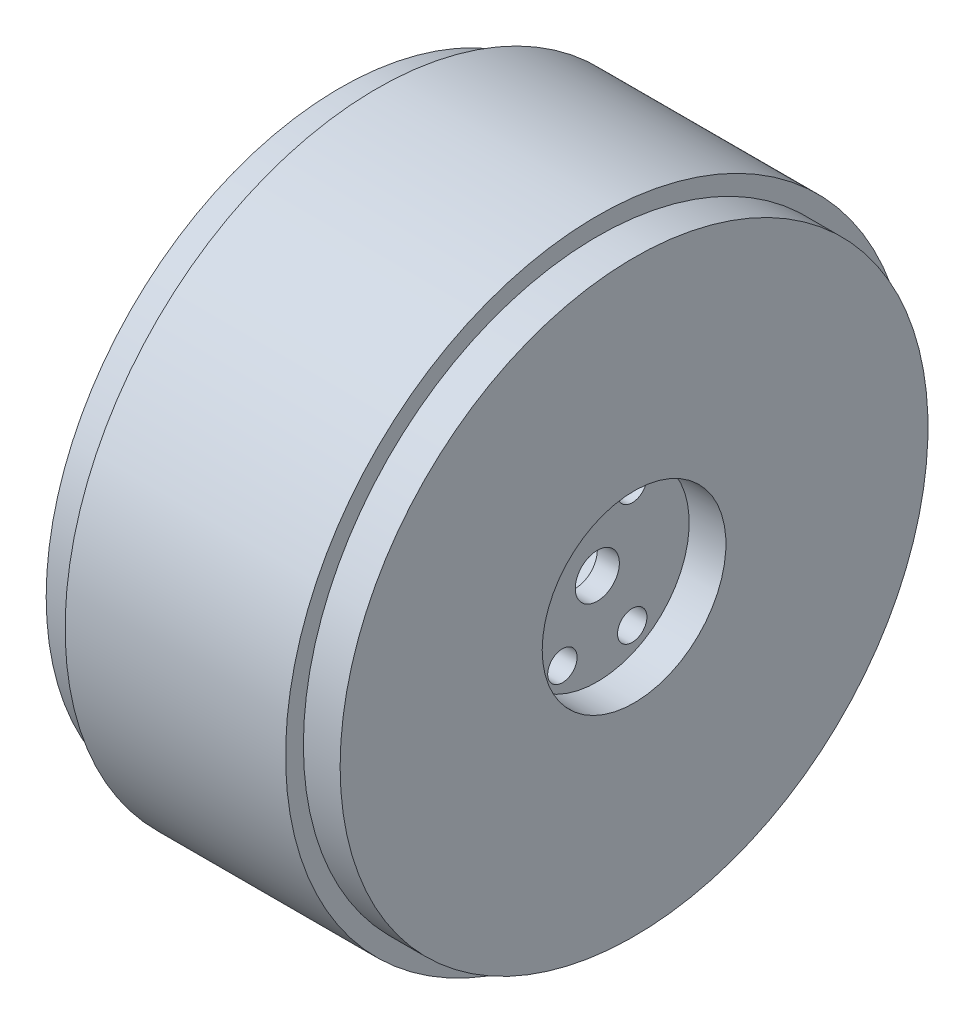
ISO-10303-21;
HEADER;
FILE_DESCRIPTION(('STEP AP214'),'2;1');
FILE_NAME('part.step','',(''),(''),'','','');
FILE_SCHEMA(('AUTOMOTIVE_DESIGN { 1 0 10303 214 1 1 1 1 }'));
ENDSEC;
DATA;
#1=APPLICATION_CONTEXT('core data for automotive mechanical design processes');
#2=APPLICATION_PROTOCOL_DEFINITION('international standard','automotive_design',2000,#1);
#3=PRODUCT_CONTEXT('',#1,'mechanical');
#4=PRODUCT('Part','Part','',(#3));
#5=PRODUCT_RELATED_PRODUCT_CATEGORY('part','',(#4));
#6=PRODUCT_DEFINITION_FORMATION('','',#4);
#7=PRODUCT_DEFINITION_CONTEXT('part definition',#1,'design');
#8=PRODUCT_DEFINITION('design','',#6,#7);
#9=PRODUCT_DEFINITION_SHAPE('','',#8);
#10=(LENGTH_UNIT() NAMED_UNIT(*) SI_UNIT(.MILLI.,.METRE.));
#11=(NAMED_UNIT(*) PLANE_ANGLE_UNIT() SI_UNIT($,.RADIAN.));
#12=(NAMED_UNIT(*) SI_UNIT($,.STERADIAN.) SOLID_ANGLE_UNIT());
#13=UNCERTAINTY_MEASURE_WITH_UNIT(LENGTH_MEASURE(1.E-05),#10,'distance_accuracy_value','');
#14=(GEOMETRIC_REPRESENTATION_CONTEXT(3) GLOBAL_UNCERTAINTY_ASSIGNED_CONTEXT((#13)) GLOBAL_UNIT_ASSIGNED_CONTEXT((#10,
#11,#12)) REPRESENTATION_CONTEXT('',''));
#15=CARTESIAN_POINT('',(0.,0.,0.));
#16=DIRECTION('',(0.,0.,1.));
#17=DIRECTION('',(1.,0.,0.));
#18=AXIS2_PLACEMENT_3D('',#15,#16,#17);
#19=CARTESIAN_POINT('',(-49.6444990272902,0.,0.));
#20=DIRECTION('',(-1.,0.,0.));
#21=DIRECTION('',(0.,0.,1.));
#22=AXIS2_PLACEMENT_3D('',#19,#20,#21);
#23=CYLINDRICAL_SURFACE('',#22,34.);
#24=CARTESIAN_POINT('',(0.,0.,0.));
#25=DIRECTION('',(-1.,0.,0.));
#26=DIRECTION('',(0.,0.,1.));
#27=AXIS2_PLACEMENT_3D('',#24,#25,#26);
#28=CIRCLE('',#27,34.);
#29=CARTESIAN_POINT('',(0.,0.,34.));
#30=VERTEX_POINT('',#29);
#31=EDGE_CURVE('E51',#30,#30,#28,.T.);
#32=ORIENTED_EDGE('',*,*,#31,.F.);
#33=EDGE_LOOP('',(#32));
#34=FACE_BOUND('',#33,.T.);
#35=CARTESIAN_POINT('',(-32.,0.,0.));
#36=DIRECTION('',(-1.,0.,0.));
#37=DIRECTION('',(0.,0.,1.));
#38=AXIS2_PLACEMENT_3D('',#35,#36,#37);
#39=CIRCLE('',#38,34.);
#40=CARTESIAN_POINT('',(-32.,0.,34.));
#41=VERTEX_POINT('',#40);
#42=EDGE_CURVE('E10',#41,#41,#39,.T.);
#43=ORIENTED_EDGE('',*,*,#42,.T.);
#44=EDGE_LOOP('',(#43));
#45=FACE_BOUND('',#44,.T.);
#46=ADVANCED_FACE('F32',(#34,#45),#23,.F.);
#47=CARTESIAN_POINT('',(-32.,34.,0.));
#48=DIRECTION('',(1.,0.,0.));
#49=DIRECTION('',(0.,0.,-1.));
#50=AXIS2_PLACEMENT_3D('',#47,#48,#49);
#51=PLANE('',#50);
#52=ORIENTED_EDGE('',*,*,#42,.F.);
#53=EDGE_LOOP('',(#52));
#54=FACE_BOUND('',#53,.T.);
#55=CARTESIAN_POINT('',(-32.,0.,0.));
#56=DIRECTION('',(-1.,0.,0.));
#57=DIRECTION('',(0.,0.,1.));
#58=AXIS2_PLACEMENT_3D('',#55,#56,#57);
#59=CIRCLE('',#58,40.);
#60=CARTESIAN_POINT('',(-32.,0.,40.));
#61=VERTEX_POINT('',#60);
#62=EDGE_CURVE('E38',#61,#61,#59,.T.);
#63=ORIENTED_EDGE('',*,*,#62,.T.);
#64=EDGE_LOOP('',(#63));
#65=FACE_BOUND('',#64,.T.);
#66=ADVANCED_FACE('F114',(#54,#65),#51,.F.);
#67=CARTESIAN_POINT('',(-49.6444990272902,0.,0.));
#68=DIRECTION('',(-1.,0.,0.));
#69=DIRECTION('',(0.,0.,1.));
#70=AXIS2_PLACEMENT_3D('',#67,#68,#69);
#71=CYLINDRICAL_SURFACE('',#70,40.);
#72=ORIENTED_EDGE('',*,*,#62,.F.);
#73=EDGE_LOOP('',(#72));
#74=FACE_BOUND('',#73,.T.);
#75=CARTESIAN_POINT('',(-27.,0.,0.));
#76=DIRECTION('',(-1.,0.,0.));
#77=DIRECTION('',(0.,0.,1.));
#78=AXIS2_PLACEMENT_3D('',#75,#76,#77);
#79=CIRCLE('',#78,40.);
#80=CARTESIAN_POINT('',(-27.,0.,40.));
#81=VERTEX_POINT('',#80);
#82=EDGE_CURVE('E90',#81,#81,#79,.T.);
#83=ORIENTED_EDGE('',*,*,#82,.T.);
#84=EDGE_LOOP('',(#83));
#85=FACE_BOUND('',#84,.T.);
#86=ADVANCED_FACE('F119',(#74,#85),#71,.T.);
#87=CARTESIAN_POINT('',(-49.6444990272902,0.,0.));
#88=DIRECTION('',(-1.,0.,0.));
#89=DIRECTION('',(0.,0.,1.));
#90=AXIS2_PLACEMENT_3D('',#87,#88,#89);
#91=CYLINDRICAL_SURFACE('',#90,40.);
#92=CARTESIAN_POINT('',(3.,0.,0.));
#93=DIRECTION('',(-1.,0.,0.));
#94=DIRECTION('',(0.,0.,1.));
#95=AXIS2_PLACEMENT_3D('',#92,#93,#94);
#96=CIRCLE('',#95,40.);
#97=CARTESIAN_POINT('',(3.,0.,40.));
#98=VERTEX_POINT('',#97);
#99=EDGE_CURVE('E42',#98,#98,#96,.T.);
#100=ORIENTED_EDGE('',*,*,#99,.F.);
#101=EDGE_LOOP('',(#100));
#102=FACE_BOUND('',#101,.T.);
#103=CARTESIAN_POINT('',(8.,0.,0.));
#104=DIRECTION('',(-1.,0.,0.));
#105=DIRECTION('',(0.,0.,1.));
#106=AXIS2_PLACEMENT_3D('',#103,#104,#105);
#107=CIRCLE('',#106,40.);
#108=CARTESIAN_POINT('',(8.,0.,40.));
#109=VERTEX_POINT('',#108);
#110=EDGE_CURVE('E46',#109,#109,#107,.T.);
#111=ORIENTED_EDGE('',*,*,#110,.T.);
#112=EDGE_LOOP('',(#111));
#113=FACE_BOUND('',#112,.T.);
#114=ADVANCED_FACE('F136',(#102,#113),#91,.T.);
#115=CARTESIAN_POINT('',(8.,40.,0.));
#116=DIRECTION('',(-1.,0.,0.));
#117=DIRECTION('',(0.,0.,1.));
#118=AXIS2_PLACEMENT_3D('',#115,#116,#117);
#119=PLANE('',#118);
#120=CARTESIAN_POINT('',(8.,0.,0.));
#121=DIRECTION('',(-1.,0.,0.));
#122=DIRECTION('',(0.,0.,1.));
#123=AXIS2_PLACEMENT_3D('',#120,#121,#122);
#124=CIRCLE('',#123,12.5);
#125=CARTESIAN_POINT('',(8.,0.,12.5));
#126=VERTEX_POINT('',#125);
#127=EDGE_CURVE('E54',#126,#126,#124,.T.);
#128=ORIENTED_EDGE('',*,*,#127,.T.);
#129=EDGE_LOOP('',(#128));
#130=FACE_BOUND('',#129,.T.);
#131=ORIENTED_EDGE('',*,*,#110,.F.);
#132=EDGE_LOOP('',(#131));
#133=FACE_BOUND('',#132,.T.);
#134=ADVANCED_FACE('F126',(#130,#133),#119,.F.);
#135=CARTESIAN_POINT('',(0.,34.,0.));
#136=DIRECTION('',(1.,0.,0.));
#137=DIRECTION('',(0.,0.,-1.));
#138=AXIS2_PLACEMENT_3D('',#135,#136,#137);
#139=PLANE('',#138);
#140=CARTESIAN_POINT('',(0.,0.,0.));
#141=DIRECTION('',(1.,0.,0.));
#142=DIRECTION('',(0.,0.,-1.));
#143=AXIS2_PLACEMENT_3D('',#140,#141,#142);
#144=CIRCLE('',#143,3.);
#145=CARTESIAN_POINT('',(0.,0.,-3.));
#146=VERTEX_POINT('',#145);
#147=EDGE_CURVE('E84',#146,#146,#144,.T.);
#148=ORIENTED_EDGE('',*,*,#147,.T.);
#149=EDGE_LOOP('',(#148));
#150=FACE_BOUND('',#149,.T.);
#151=CARTESIAN_POINT('',(0.,8.22724133595216,4.75000000000001));
#152=DIRECTION('',(1.,0.,0.));
#153=DIRECTION('',(0.,0.,-1.));
#154=AXIS2_PLACEMENT_3D('',#151,#152,#153);
#155=CIRCLE('',#154,2.);
#156=CARTESIAN_POINT('',(0.,8.22724133595216,2.75000000000001));
#157=VERTEX_POINT('',#156);
#158=EDGE_CURVE('E60',#157,#157,#155,.T.);
#159=ORIENTED_EDGE('',*,*,#158,.T.);
#160=EDGE_LOOP('',(#159));
#161=FACE_BOUND('',#160,.T.);
#162=CARTESIAN_POINT('',(0.,-8.22724133595216,-4.75000000000001));
#163=DIRECTION('',(1.,0.,0.));
#164=DIRECTION('',(0.,0.,-1.));
#165=AXIS2_PLACEMENT_3D('',#162,#163,#164);
#166=CIRCLE('',#165,2.);
#167=CARTESIAN_POINT('',(0.,-8.22724133595216,-6.75000000000001));
#168=VERTEX_POINT('',#167);
#169=EDGE_CURVE('E63',#168,#168,#166,.T.);
#170=ORIENTED_EDGE('',*,*,#169,.T.);
#171=EDGE_LOOP('',(#170));
#172=FACE_BOUND('',#171,.T.);
#173=CARTESIAN_POINT('',(0.,-8.22724133595216,4.75000000000001));
#174=DIRECTION('',(1.,0.,0.));
#175=DIRECTION('',(0.,0.,-1.));
#176=AXIS2_PLACEMENT_3D('',#173,#174,#175);
#177=CIRCLE('',#176,2.);
#178=CARTESIAN_POINT('',(0.,-8.22724133595216,2.75000000000001));
#179=VERTEX_POINT('',#178);
#180=EDGE_CURVE('E66',#179,#179,#177,.T.);
#181=ORIENTED_EDGE('',*,*,#180,.T.);
#182=EDGE_LOOP('',(#181));
#183=FACE_BOUND('',#182,.T.);
#184=CARTESIAN_POINT('',(0.,8.22724133595216,-4.75000000000001));
#185=DIRECTION('',(1.,0.,0.));
#186=DIRECTION('',(0.,0.,-1.));
#187=AXIS2_PLACEMENT_3D('',#184,#185,#186);
#188=CIRCLE('',#187,2.);
#189=CARTESIAN_POINT('',(0.,8.22724133595216,-6.75000000000001));
#190=VERTEX_POINT('',#189);
#191=EDGE_CURVE('E69',#190,#190,#188,.T.);
#192=ORIENTED_EDGE('',*,*,#191,.T.);
#193=EDGE_LOOP('',(#192));
#194=FACE_BOUND('',#193,.T.);
#195=ORIENTED_EDGE('',*,*,#31,.T.);
#196=EDGE_LOOP('',(#195));
#197=FACE_BOUND('',#196,.T.);
#198=ADVANCED_FACE('F123',(#150,#161,#172,#183,#194,#197),#139,.F.);
#199=CARTESIAN_POINT('',(0.,0.,0.));
#200=DIRECTION('',(-1.,0.,0.));
#201=DIRECTION('',(0.,0.,1.));
#202=AXIS2_PLACEMENT_3D('',#199,#200,#201);
#203=CYLINDRICAL_SURFACE('',#202,12.5);
#204=CARTESIAN_POINT('',(3.,0.,0.));
#205=DIRECTION('',(-1.,0.,0.));
#206=DIRECTION('',(0.,0.,1.));
#207=AXIS2_PLACEMENT_3D('',#204,#205,#206);
#208=CIRCLE('',#207,12.5);
#209=CARTESIAN_POINT('',(3.,0.,12.5));
#210=VERTEX_POINT('',#209);
#211=EDGE_CURVE('E57',#210,#210,#208,.T.);
#212=ORIENTED_EDGE('',*,*,#211,.T.);
#213=EDGE_LOOP('',(#212));
#214=FACE_BOUND('',#213,.T.);
#215=ORIENTED_EDGE('',*,*,#127,.F.);
#216=EDGE_LOOP('',(#215));
#217=FACE_BOUND('',#216,.T.);
#218=ADVANCED_FACE('F125',(#214,#217),#203,.F.);
#219=CARTESIAN_POINT('',(3.,12.5,0.));
#220=DIRECTION('',(1.,0.,0.));
#221=DIRECTION('',(0.,0.,-1.));
#222=AXIS2_PLACEMENT_3D('',#219,#220,#221);
#223=PLANE('',#222);
#224=CARTESIAN_POINT('',(3.,0.,0.));
#225=DIRECTION('',(1.,0.,0.));
#226=DIRECTION('',(0.,0.,-1.));
#227=AXIS2_PLACEMENT_3D('',#224,#225,#226);
#228=CIRCLE('',#227,3.);
#229=CARTESIAN_POINT('',(3.,0.,-3.));
#230=VERTEX_POINT('',#229);
#231=EDGE_CURVE('E87',#230,#230,#228,.T.);
#232=ORIENTED_EDGE('',*,*,#231,.F.);
#233=EDGE_LOOP('',(#232));
#234=FACE_BOUND('',#233,.T.);
#235=CARTESIAN_POINT('',(3.,8.22724133595216,4.75000000000001));
#236=DIRECTION('',(1.,0.,0.));
#237=DIRECTION('',(0.,0.,1.));
#238=AXIS2_PLACEMENT_3D('',#235,#236,#237);
#239=CIRCLE('',#238,2.);
#240=CARTESIAN_POINT('',(3.,8.22724133595216,6.75000000000001));
#241=VERTEX_POINT('',#240);
#242=EDGE_CURVE('E75',#241,#241,#239,.T.);
#243=ORIENTED_EDGE('',*,*,#242,.F.);
#244=EDGE_LOOP('',(#243));
#245=FACE_BOUND('',#244,.T.);
#246=CARTESIAN_POINT('',(3.,-8.22724133595216,-4.75000000000001));
#247=DIRECTION('',(1.,0.,0.));
#248=DIRECTION('',(0.,0.,1.));
#249=AXIS2_PLACEMENT_3D('',#246,#247,#248);
#250=CIRCLE('',#249,2.);
#251=CARTESIAN_POINT('',(3.,-8.22724133595216,-2.75000000000001));
#252=VERTEX_POINT('',#251);
#253=EDGE_CURVE('E76',#252,#252,#250,.T.);
#254=ORIENTED_EDGE('',*,*,#253,.F.);
#255=EDGE_LOOP('',(#254));
#256=FACE_BOUND('',#255,.T.);
#257=CARTESIAN_POINT('',(3.,-8.22724133595216,4.75000000000001));
#258=DIRECTION('',(1.,0.,0.));
#259=DIRECTION('',(0.,0.,-1.));
#260=AXIS2_PLACEMENT_3D('',#257,#258,#259);
#261=CIRCLE('',#260,2.);
#262=CARTESIAN_POINT('',(3.,-8.22724133595216,2.75000000000001));
#263=VERTEX_POINT('',#262);
#264=EDGE_CURVE('E79',#263,#263,#261,.T.);
#265=ORIENTED_EDGE('',*,*,#264,.F.);
#266=EDGE_LOOP('',(#265));
#267=FACE_BOUND('',#266,.T.);
#268=CARTESIAN_POINT('',(3.,8.22724133595216,-4.75000000000001));
#269=DIRECTION('',(1.,0.,0.));
#270=DIRECTION('',(0.,0.,-1.));
#271=AXIS2_PLACEMENT_3D('',#268,#269,#270);
#272=CIRCLE('',#271,2.);
#273=CARTESIAN_POINT('',(3.,8.22724133595216,-6.75000000000001));
#274=VERTEX_POINT('',#273);
#275=EDGE_CURVE('E72',#274,#274,#272,.T.);
#276=ORIENTED_EDGE('',*,*,#275,.F.);
#277=EDGE_LOOP('',(#276));
#278=FACE_BOUND('',#277,.T.);
#279=ORIENTED_EDGE('',*,*,#211,.F.);
#280=EDGE_LOOP('',(#279));
#281=FACE_BOUND('',#280,.T.);
#282=ADVANCED_FACE('F133',(#234,#245,#256,#267,#278,#281),#223,.T.);
#283=CARTESIAN_POINT('',(-32.,8.22724133595216,-4.75000000000001));
#284=DIRECTION('',(1.,0.,0.));
#285=DIRECTION('',(0.,0.,-1.));
#286=AXIS2_PLACEMENT_3D('',#283,#284,#285);
#287=CYLINDRICAL_SURFACE('',#286,2.);
#288=ORIENTED_EDGE('',*,*,#275,.T.);
#289=EDGE_LOOP('',(#288));
#290=FACE_BOUND('',#289,.T.);
#291=ORIENTED_EDGE('',*,*,#191,.F.);
#292=EDGE_LOOP('',(#291));
#293=FACE_BOUND('',#292,.T.);
#294=ADVANCED_FACE('F167',(#290,#293),#287,.F.);
#295=CARTESIAN_POINT('',(-32.,-8.22724133595216,4.75000000000001));
#296=DIRECTION('',(1.,0.,0.));
#297=DIRECTION('',(0.,0.,-1.));
#298=AXIS2_PLACEMENT_3D('',#295,#296,#297);
#299=CYLINDRICAL_SURFACE('',#298,2.);
#300=ORIENTED_EDGE('',*,*,#264,.T.);
#301=EDGE_LOOP('',(#300));
#302=FACE_BOUND('',#301,.T.);
#303=ORIENTED_EDGE('',*,*,#180,.F.);
#304=EDGE_LOOP('',(#303));
#305=FACE_BOUND('',#304,.T.);
#306=ADVANCED_FACE('F163',(#302,#305),#299,.F.);
#307=CARTESIAN_POINT('',(-32.,-8.22724133595216,-4.75000000000001));
#308=DIRECTION('',(1.,0.,0.));
#309=DIRECTION('',(0.,0.,-1.));
#310=AXIS2_PLACEMENT_3D('',#307,#308,#309);
#311=CYLINDRICAL_SURFACE('',#310,2.);
#312=ORIENTED_EDGE('',*,*,#253,.T.);
#313=EDGE_LOOP('',(#312));
#314=FACE_BOUND('',#313,.T.);
#315=ORIENTED_EDGE('',*,*,#169,.F.);
#316=EDGE_LOOP('',(#315));
#317=FACE_BOUND('',#316,.T.);
#318=ADVANCED_FACE('F166',(#314,#317),#311,.F.);
#319=CARTESIAN_POINT('',(-32.,8.22724133595216,4.75000000000001));
#320=DIRECTION('',(1.,0.,0.));
#321=DIRECTION('',(0.,0.,-1.));
#322=AXIS2_PLACEMENT_3D('',#319,#320,#321);
#323=CYLINDRICAL_SURFACE('',#322,2.);
#324=ORIENTED_EDGE('',*,*,#242,.T.);
#325=EDGE_LOOP('',(#324));
#326=FACE_BOUND('',#325,.T.);
#327=ORIENTED_EDGE('',*,*,#158,.F.);
#328=EDGE_LOOP('',(#327));
#329=FACE_BOUND('',#328,.T.);
#330=ADVANCED_FACE('F158',(#326,#329),#323,.F.);
#331=CARTESIAN_POINT('',(-32.,0.,0.));
#332=DIRECTION('',(1.,0.,0.));
#333=DIRECTION('',(0.,0.,-1.));
#334=AXIS2_PLACEMENT_3D('',#331,#332,#333);
#335=CYLINDRICAL_SURFACE('',#334,3.);
#336=ORIENTED_EDGE('',*,*,#231,.T.);
#337=EDGE_LOOP('',(#336));
#338=FACE_BOUND('',#337,.T.);
#339=ORIENTED_EDGE('',*,*,#147,.F.);
#340=EDGE_LOOP('',(#339));
#341=FACE_BOUND('',#340,.T.);
#342=ADVANCED_FACE('F153',(#338,#341),#335,.F.);
#343=CARTESIAN_POINT('',(-27.,39.,0.));
#344=DIRECTION('',(-1.,0.,0.));
#345=DIRECTION('',(0.,0.,1.));
#346=AXIS2_PLACEMENT_3D('',#343,#344,#345);
#347=PLANE('',#346);
#348=CARTESIAN_POINT('',(-27.,0.,0.));
#349=DIRECTION('',(1.,0.,0.));
#350=DIRECTION('',(0.,0.,-1.));
#351=AXIS2_PLACEMENT_3D('',#348,#349,#350);
#352=CIRCLE('',#351,42.4219137981652);
#353=CARTESIAN_POINT('',(-27.,0.,-42.4219137981652));
#354=VERTEX_POINT('',#353);
#355=EDGE_CURVE('E93',#354,#354,#352,.T.);
#356=ORIENTED_EDGE('',*,*,#355,.F.);
#357=EDGE_LOOP('',(#356));
#358=FACE_BOUND('',#357,.T.);
#359=ORIENTED_EDGE('',*,*,#82,.F.);
#360=EDGE_LOOP('',(#359));
#361=FACE_BOUND('',#360,.T.);
#362=ADVANCED_FACE('F109',(#358,#361),#347,.T.);
#363=CARTESIAN_POINT('',(3.,42.4219137981652,0.));
#364=DIRECTION('',(1.,0.,0.));
#365=DIRECTION('',(0.,0.,-1.));
#366=AXIS2_PLACEMENT_3D('',#363,#364,#365);
#367=PLANE('',#366);
#368=ORIENTED_EDGE('',*,*,#99,.T.);
#369=EDGE_LOOP('',(#368));
#370=FACE_BOUND('',#369,.T.);
#371=CARTESIAN_POINT('',(3.,0.,0.));
#372=DIRECTION('',(1.,0.,0.));
#373=DIRECTION('',(0.,0.,-1.));
#374=AXIS2_PLACEMENT_3D('',#371,#372,#373);
#375=CIRCLE('',#374,42.4219137981652);
#376=CARTESIAN_POINT('',(3.,0.,-42.4219137981652));
#377=VERTEX_POINT('',#376);
#378=EDGE_CURVE('E96',#377,#377,#375,.T.);
#379=ORIENTED_EDGE('',*,*,#378,.T.);
#380=EDGE_LOOP('',(#379));
#381=FACE_BOUND('',#380,.T.);
#382=ADVANCED_FACE('F100',(#370,#381),#367,.T.);
#383=CARTESIAN_POINT('',(0.,0.,0.));
#384=DIRECTION('',(1.,0.,0.));
#385=DIRECTION('',(0.,0.,-1.));
#386=AXIS2_PLACEMENT_3D('',#383,#384,#385);
#387=CYLINDRICAL_SURFACE('',#386,42.4219137981652);
#388=ORIENTED_EDGE('',*,*,#355,.T.);
#389=EDGE_LOOP('',(#388));
#390=FACE_BOUND('',#389,.T.);
#391=ORIENTED_EDGE('',*,*,#378,.F.);
#392=EDGE_LOOP('',(#391));
#393=FACE_BOUND('',#392,.T.);
#394=ADVANCED_FACE('F102',(#390,#393),#387,.T.);
#395=CLOSED_SHELL('',(#46,#66,#86,#114,#134,#198,#218,#282,#294,#306,#318,#330,#342,#362,#382,#394));
#396=MANIFOLD_SOLID_BREP('B2',#395);
#397=ADVANCED_BREP_SHAPE_REPRESENTATION('',(#18,#396),#14);
#398=SHAPE_DEFINITION_REPRESENTATION(#9,#397);
ENDSEC;
END-ISO-10303-21;
